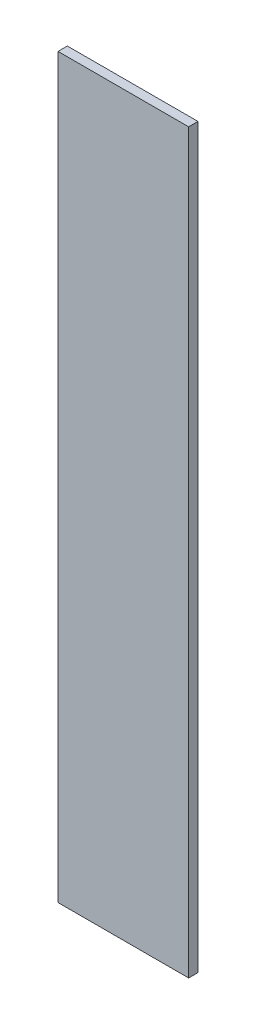
ISO-10303-21;
HEADER;
FILE_DESCRIPTION(('STEP AP214'),'2;1');
FILE_NAME('part.step','',(''),(''),'','','');
FILE_SCHEMA(('AUTOMOTIVE_DESIGN { 1 0 10303 214 1 1 1 1 }'));
ENDSEC;
DATA;
#1=APPLICATION_CONTEXT('core data for automotive mechanical design processes');
#2=APPLICATION_PROTOCOL_DEFINITION('international standard','automotive_design',2000,#1);
#3=PRODUCT_CONTEXT('',#1,'mechanical');
#4=PRODUCT('Part','Part','',(#3));
#5=PRODUCT_RELATED_PRODUCT_CATEGORY('part','',(#4));
#6=PRODUCT_DEFINITION_FORMATION('','',#4);
#7=PRODUCT_DEFINITION_CONTEXT('part definition',#1,'design');
#8=PRODUCT_DEFINITION('design','',#6,#7);
#9=PRODUCT_DEFINITION_SHAPE('','',#8);
#10=(LENGTH_UNIT() NAMED_UNIT(*) SI_UNIT(.MILLI.,.METRE.));
#11=(NAMED_UNIT(*) PLANE_ANGLE_UNIT() SI_UNIT($,.RADIAN.));
#12=(NAMED_UNIT(*) SI_UNIT($,.STERADIAN.) SOLID_ANGLE_UNIT());
#13=UNCERTAINTY_MEASURE_WITH_UNIT(LENGTH_MEASURE(1.E-05),#10,'distance_accuracy_value','');
#14=(GEOMETRIC_REPRESENTATION_CONTEXT(3) GLOBAL_UNCERTAINTY_ASSIGNED_CONTEXT((#13)) GLOBAL_UNIT_ASSIGNED_CONTEXT((#10,
#11,#12)) REPRESENTATION_CONTEXT('',''));
#15=CARTESIAN_POINT('',(0.,0.,0.));
#16=DIRECTION('',(0.,0.,1.));
#17=DIRECTION('',(1.,0.,0.));
#18=AXIS2_PLACEMENT_3D('',#15,#16,#17);
#19=CARTESIAN_POINT('',(0.,0.,6.35));
#20=DIRECTION('',(0.,0.,1.));
#21=DIRECTION('',(1.,0.,0.));
#22=AXIS2_PLACEMENT_3D('',#19,#20,#21);
#23=PLANE('',#22);
#24=DIRECTION('',(0.,1.,0.));
#25=VECTOR('',#24,1.);
#26=CARTESIAN_POINT('',(0.,501.65,6.35));
#27=LINE('',#26,#25);
#28=CARTESIAN_POINT('',(0.,0.,6.35));
#29=VERTEX_POINT('',#28);
#30=CARTESIAN_POINT('',(0.,501.65,6.35));
#31=VERTEX_POINT('',#30);
#32=EDGE_CURVE('E68',#29,#31,#27,.T.);
#33=ORIENTED_EDGE('',*,*,#32,.F.);
#34=DIRECTION('',(1.,0.,0.));
#35=VECTOR('',#34,1.);
#36=CARTESIAN_POINT('',(0.,0.,6.35));
#37=LINE('',#36,#35);
#38=CARTESIAN_POINT('',(88.9,0.,6.35));
#39=VERTEX_POINT('',#38);
#40=EDGE_CURVE('E20',#39,#29,#37,.F.);
#41=ORIENTED_EDGE('',*,*,#40,.F.);
#42=DIRECTION('',(0.,1.,0.));
#43=VECTOR('',#42,1.);
#44=CARTESIAN_POINT('',(88.9,0.,6.35));
#45=LINE('',#44,#43);
#46=CARTESIAN_POINT('',(88.9,501.65,6.35));
#47=VERTEX_POINT('',#46);
#48=EDGE_CURVE('E58',#47,#39,#45,.F.);
#49=ORIENTED_EDGE('',*,*,#48,.F.);
#50=DIRECTION('',(1.,0.,0.));
#51=VECTOR('',#50,1.);
#52=CARTESIAN_POINT('',(88.9,501.65,6.35));
#53=LINE('',#52,#51);
#54=EDGE_CURVE('E53',#31,#47,#53,.T.);
#55=ORIENTED_EDGE('',*,*,#54,.F.);
#56=EDGE_LOOP('',(#33,#41,#49,#55));
#57=FACE_BOUND('',#56,.T.);
#58=ADVANCED_FACE('F17',(#57),#23,.T.);
#59=CARTESIAN_POINT('',(0.,0.,0.));
#60=DIRECTION('',(0.,-1.,0.));
#61=DIRECTION('',(0.,0.,-1.));
#62=AXIS2_PLACEMENT_3D('',#59,#60,#61);
#63=PLANE('',#62);
#64=DIRECTION('',(0.,0.,1.));
#65=VECTOR('',#64,1.);
#66=CARTESIAN_POINT('',(0.,0.,0.));
#67=LINE('',#66,#65);
#68=CARTESIAN_POINT('',(0.,0.,0.));
#69=VERTEX_POINT('',#68);
#70=EDGE_CURVE('E79',#69,#29,#67,.T.);
#71=ORIENTED_EDGE('',*,*,#70,.F.);
#72=DIRECTION('',(1.,0.,0.));
#73=VECTOR('',#72,1.);
#74=CARTESIAN_POINT('',(0.,0.,0.));
#75=LINE('',#74,#73);
#76=CARTESIAN_POINT('',(88.9,0.,0.));
#77=VERTEX_POINT('',#76);
#78=EDGE_CURVE('E74',#69,#77,#75,.T.);
#79=ORIENTED_EDGE('',*,*,#78,.T.);
#80=DIRECTION('',(0.,0.,-1.));
#81=VECTOR('',#80,1.);
#82=CARTESIAN_POINT('',(88.9,0.,0.));
#83=LINE('',#82,#81);
#84=EDGE_CURVE('E63',#39,#77,#83,.T.);
#85=ORIENTED_EDGE('',*,*,#84,.F.);
#86=ORIENTED_EDGE('',*,*,#40,.T.);
#87=EDGE_LOOP('',(#71,#79,#85,#86));
#88=FACE_BOUND('',#87,.T.);
#89=ADVANCED_FACE('F73',(#88),#63,.T.);
#90=CARTESIAN_POINT('',(88.9,0.,0.));
#91=DIRECTION('',(1.,0.,0.));
#92=DIRECTION('',(0.,0.,-1.));
#93=AXIS2_PLACEMENT_3D('',#90,#91,#92);
#94=PLANE('',#93);
#95=ORIENTED_EDGE('',*,*,#84,.T.);
#96=DIRECTION('',(0.,1.,0.));
#97=VECTOR('',#96,1.);
#98=CARTESIAN_POINT('',(88.9,0.,0.));
#99=LINE('',#98,#97);
#100=CARTESIAN_POINT('',(88.9,501.65,0.));
#101=VERTEX_POINT('',#100);
#102=EDGE_CURVE('E84',#77,#101,#99,.T.);
#103=ORIENTED_EDGE('',*,*,#102,.T.);
#104=DIRECTION('',(0.,0.,1.));
#105=VECTOR('',#104,1.);
#106=CARTESIAN_POINT('',(88.9,501.65,0.));
#107=LINE('',#106,#105);
#108=EDGE_CURVE('E65',#47,#101,#107,.F.);
#109=ORIENTED_EDGE('',*,*,#108,.F.);
#110=ORIENTED_EDGE('',*,*,#48,.T.);
#111=EDGE_LOOP('',(#95,#103,#109,#110));
#112=FACE_BOUND('',#111,.T.);
#113=ADVANCED_FACE('F60',(#112),#94,.T.);
#114=CARTESIAN_POINT('',(88.9,501.65,0.));
#115=DIRECTION('',(0.,1.,0.));
#116=DIRECTION('',(0.,0.,1.));
#117=AXIS2_PLACEMENT_3D('',#114,#115,#116);
#118=PLANE('',#117);
#119=ORIENTED_EDGE('',*,*,#108,.T.);
#120=DIRECTION('',(1.,0.,0.));
#121=VECTOR('',#120,1.);
#122=CARTESIAN_POINT('',(0.,501.65,0.));
#123=LINE('',#122,#121);
#124=CARTESIAN_POINT('',(0.,501.65,0.));
#125=VERTEX_POINT('',#124);
#126=EDGE_CURVE('E26',#101,#125,#123,.F.);
#127=ORIENTED_EDGE('',*,*,#126,.T.);
#128=DIRECTION('',(0.,0.,1.));
#129=VECTOR('',#128,1.);
#130=CARTESIAN_POINT('',(0.,501.65,0.));
#131=LINE('',#130,#129);
#132=EDGE_CURVE('E34',#31,#125,#131,.F.);
#133=ORIENTED_EDGE('',*,*,#132,.F.);
#134=ORIENTED_EDGE('',*,*,#54,.T.);
#135=EDGE_LOOP('',(#119,#127,#133,#134));
#136=FACE_BOUND('',#135,.T.);
#137=ADVANCED_FACE('F88',(#136),#118,.T.);
#138=CARTESIAN_POINT('',(0.,501.65,0.));
#139=DIRECTION('',(-1.,0.,0.));
#140=DIRECTION('',(0.,0.,1.));
#141=AXIS2_PLACEMENT_3D('',#138,#139,#140);
#142=PLANE('',#141);
#143=ORIENTED_EDGE('',*,*,#132,.T.);
#144=DIRECTION('',(0.,1.,0.));
#145=VECTOR('',#144,1.);
#146=CARTESIAN_POINT('',(0.,0.,0.));
#147=LINE('',#146,#145);
#148=EDGE_CURVE('E11',#125,#69,#147,.F.);
#149=ORIENTED_EDGE('',*,*,#148,.T.);
#150=ORIENTED_EDGE('',*,*,#70,.T.);
#151=ORIENTED_EDGE('',*,*,#32,.T.);
#152=EDGE_LOOP('',(#143,#149,#150,#151));
#153=FACE_BOUND('',#152,.T.);
#154=ADVANCED_FACE('F91',(#153),#142,.T.);
#155=CARTESIAN_POINT('',(0.,0.,0.));
#156=DIRECTION('',(0.,0.,1.));
#157=DIRECTION('',(1.,0.,0.));
#158=AXIS2_PLACEMENT_3D('',#155,#156,#157);
#159=PLANE('',#158);
#160=ORIENTED_EDGE('',*,*,#126,.F.);
#161=ORIENTED_EDGE('',*,*,#102,.F.);
#162=ORIENTED_EDGE('',*,*,#78,.F.);
#163=ORIENTED_EDGE('',*,*,#148,.F.);
#164=EDGE_LOOP('',(#160,#161,#162,#163));
#165=FACE_BOUND('',#164,.T.);
#166=ADVANCED_FACE('F90',(#165),#159,.F.);
#167=CLOSED_SHELL('',(#58,#89,#113,#137,#154,#166));
#168=MANIFOLD_SOLID_BREP('B1',#167);
#169=ADVANCED_BREP_SHAPE_REPRESENTATION('',(#18,#168),#14);
#170=SHAPE_DEFINITION_REPRESENTATION(#9,#169);
ENDSEC;
END-ISO-10303-21;
